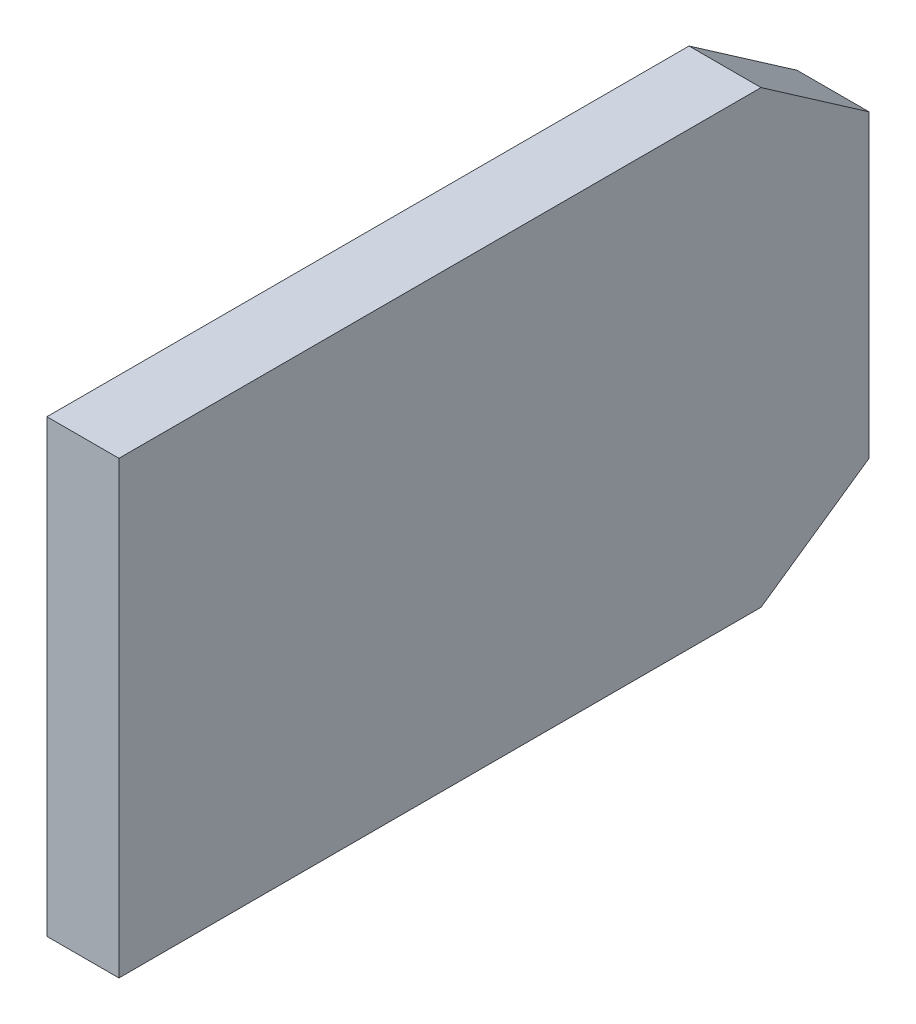
ISO-10303-21;
HEADER;
FILE_DESCRIPTION(('STEP AP214'),'2;1');
FILE_NAME('part.step','',(''),(''),'','','');
FILE_SCHEMA(('AUTOMOTIVE_DESIGN { 1 0 10303 214 1 1 1 1 }'));
ENDSEC;
DATA;
#1=APPLICATION_CONTEXT('core data for automotive mechanical design processes');
#2=APPLICATION_PROTOCOL_DEFINITION('international standard','automotive_design',2000,#1);
#3=PRODUCT_CONTEXT('',#1,'mechanical');
#4=PRODUCT('Part','Part','',(#3));
#5=PRODUCT_RELATED_PRODUCT_CATEGORY('part','',(#4));
#6=PRODUCT_DEFINITION_FORMATION('','',#4);
#7=PRODUCT_DEFINITION_CONTEXT('part definition',#1,'design');
#8=PRODUCT_DEFINITION('design','',#6,#7);
#9=PRODUCT_DEFINITION_SHAPE('','',#8);
#10=(LENGTH_UNIT() NAMED_UNIT(*) SI_UNIT(.MILLI.,.METRE.));
#11=(NAMED_UNIT(*) PLANE_ANGLE_UNIT() SI_UNIT($,.RADIAN.));
#12=(NAMED_UNIT(*) SI_UNIT($,.STERADIAN.) SOLID_ANGLE_UNIT());
#13=UNCERTAINTY_MEASURE_WITH_UNIT(LENGTH_MEASURE(1.E-05),#10,'distance_accuracy_value','');
#14=(GEOMETRIC_REPRESENTATION_CONTEXT(3) GLOBAL_UNCERTAINTY_ASSIGNED_CONTEXT((#13)) GLOBAL_UNIT_ASSIGNED_CONTEXT((#10,
#11,#12)) REPRESENTATION_CONTEXT('',''));
#15=CARTESIAN_POINT('',(0.,0.,0.));
#16=DIRECTION('',(0.,0.,1.));
#17=DIRECTION('',(1.,0.,0.));
#18=AXIS2_PLACEMENT_3D('',#15,#16,#17);
#19=CARTESIAN_POINT('',(-4.73075000000017,1.16063201513406,-16.2306000000013));
#20=DIRECTION('',(-1.,0.,0.));
#21=DIRECTION('',(0.,0.,1.));
#22=AXIS2_PLACEMENT_3D('',#19,#20,#21);
#23=PLANE('',#22);
#24=DIRECTION('',(0.,1.,0.));
#25=VECTOR('',#24,1.);
#26=CARTESIAN_POINT('',(-4.73075000000017,2.06621600756764,-16.2306000000026));
#27=LINE('',#26,#25);
#28=CARTESIAN_POINT('',(-4.73075000000017,-3.60186798486594,-16.2306000000019));
#29=VERTEX_POINT('',#28);
#30=CARTESIAN_POINT('',(-4.73075000000017,1.16063201513406,-16.2306000000016));
#31=VERTEX_POINT('',#30);
#32=EDGE_CURVE('E81',#29,#31,#27,.T.);
#33=ORIENTED_EDGE('',*,*,#32,.T.);
#34=DIRECTION('',(0.,0.,1.));
#35=VECTOR('',#34,1.);
#36=CARTESIAN_POINT('',(-4.73075000000017,1.16063201513406,-16.2306000000013));
#37=LINE('',#36,#35);
#38=CARTESIAN_POINT('',(-4.73075000000017,1.16063201513406,-23.0251000000013));
#39=VERTEX_POINT('',#38);
#40=EDGE_CURVE('E68',#39,#31,#37,.T.);
#41=ORIENTED_EDGE('',*,*,#40,.F.);
#42=DIRECTION('',(0.,0.570395809495343,0.821369965673297));
#43=VECTOR('',#42,1.);
#44=CARTESIAN_POINT('',(-4.73075000000017,0.763757015134061,-23.5966000000013));
#45=LINE('',#44,#43);
#46=CARTESIAN_POINT('',(-4.73075000000017,0.366882015134067,-24.1681000000013));
#47=VERTEX_POINT('',#46);
#48=EDGE_CURVE('E20',#47,#39,#45,.T.);
#49=ORIENTED_EDGE('',*,*,#48,.F.);
#50=DIRECTION('',(0.,1.,0.));
#51=VECTOR('',#50,1.);
#52=CARTESIAN_POINT('',(-4.73075000000017,-1.22061798486595,-24.1681000000013));
#53=LINE('',#52,#51);
#54=CARTESIAN_POINT('',(-4.73075000000017,-2.80811798486594,-24.1681000000013));
#55=VERTEX_POINT('',#54);
#56=EDGE_CURVE('E102',#47,#55,#53,.F.);
#57=ORIENTED_EDGE('',*,*,#56,.T.);
#58=DIRECTION('',(0.,0.570395809495342,-0.821369965673297));
#59=VECTOR('',#58,1.);
#60=CARTESIAN_POINT('',(-4.73075000000019,-3.20499298486595,-23.5966000000013));
#61=LINE('',#60,#59);
#62=CARTESIAN_POINT('',(-4.73075000000017,-3.60186798486594,-23.0251000000013));
#63=VERTEX_POINT('',#62);
#64=EDGE_CURVE('E100',#63,#55,#61,.T.);
#65=ORIENTED_EDGE('',*,*,#64,.F.);
#66=DIRECTION('',(0.,0.,1.));
#67=VECTOR('',#66,1.);
#68=CARTESIAN_POINT('',(-4.73075000000017,-3.60186798486595,-16.2306000000013));
#69=LINE('',#68,#67);
#70=EDGE_CURVE('E95',#29,#63,#69,.F.);
#71=ORIENTED_EDGE('',*,*,#70,.F.);
#72=EDGE_LOOP('',(#33,#41,#49,#57,#65,#71));
#73=FACE_BOUND('',#72,.T.);
#74=ADVANCED_FACE('F17',(#73),#23,.T.);
#75=CARTESIAN_POINT('',(-4.15925000000017,0.763757015134061,-23.5966000000013));
#76=DIRECTION('',(0.,0.821369965673297,-0.570395809495343));
#77=DIRECTION('',(0.,0.570395809495343,0.821369965673297));
#78=AXIS2_PLACEMENT_3D('',#75,#76,#77);
#79=PLANE('',#78);
#80=DIRECTION('',(0.,0.570395809495341,0.821369965673298));
#81=VECTOR('',#80,1.);
#82=CARTESIAN_POINT('',(-3.96875000000017,0.366882015134067,-24.1681000000013));
#83=LINE('',#82,#81);
#84=CARTESIAN_POINT('',(-3.96875000000017,0.366882015134066,-24.1681000000013));
#85=VERTEX_POINT('',#84);
#86=CARTESIAN_POINT('',(-3.96875000000017,1.16063201513406,-23.0251000000013));
#87=VERTEX_POINT('',#86);
#88=EDGE_CURVE('E106',#85,#87,#83,.T.);
#89=ORIENTED_EDGE('',*,*,#88,.F.);
#90=DIRECTION('',(1.,0.,0.));
#91=VECTOR('',#90,1.);
#92=CARTESIAN_POINT('',(-4.34975000000017,0.366882015134067,-24.1681000000013));
#93=LINE('',#92,#91);
#94=EDGE_CURVE('E77',#85,#47,#93,.F.);
#95=ORIENTED_EDGE('',*,*,#94,.T.);
#96=ORIENTED_EDGE('',*,*,#48,.T.);
#97=DIRECTION('',(-1.,0.,0.));
#98=VECTOR('',#97,1.);
#99=CARTESIAN_POINT('',(-3.96875000000017,1.16063201513406,-23.0251000000013));
#100=LINE('',#99,#98);
#101=EDGE_CURVE('E74',#87,#39,#100,.T.);
#102=ORIENTED_EDGE('',*,*,#101,.F.);
#103=EDGE_LOOP('',(#89,#95,#96,#102));
#104=FACE_BOUND('',#103,.T.);
#105=ADVANCED_FACE('F73',(#104),#79,.T.);
#106=CARTESIAN_POINT('',(-3.96875000000017,1.16063201513406,-16.2306000000013));
#107=DIRECTION('',(0.,1.,0.));
#108=DIRECTION('',(-1.,0.,0.));
#109=AXIS2_PLACEMENT_3D('',#106,#107,#108);
#110=PLANE('',#109);
#111=DIRECTION('',(-1.,0.,0.));
#112=VECTOR('',#111,1.);
#113=CARTESIAN_POINT('',(-2.66453525910038E-13,1.16063201513406,-16.2306000000026));
#114=LINE('',#113,#112);
#115=CARTESIAN_POINT('',(-3.96875000000017,1.16063201513406,-16.2306000000016));
#116=VERTEX_POINT('',#115);
#117=EDGE_CURVE('E83',#31,#116,#114,.F.);
#118=ORIENTED_EDGE('',*,*,#117,.T.);
#119=DIRECTION('',(0.,0.,-1.));
#120=VECTOR('',#119,1.);
#121=CARTESIAN_POINT('',(-3.96875000000017,1.16063201513406,-16.2306000000013));
#122=LINE('',#121,#120);
#123=EDGE_CURVE('E87',#87,#116,#122,.F.);
#124=ORIENTED_EDGE('',*,*,#123,.F.);
#125=ORIENTED_EDGE('',*,*,#101,.T.);
#126=ORIENTED_EDGE('',*,*,#40,.T.);
#127=EDGE_LOOP('',(#118,#124,#125,#126));
#128=FACE_BOUND('',#127,.T.);
#129=ADVANCED_FACE('F85',(#128),#110,.T.);
#130=CARTESIAN_POINT('',(-2.66453525910038E-13,2.06621600756764,-16.2306000000026));
#131=DIRECTION('',(0.,0.,-1.));
#132=DIRECTION('',(-1.,0.,0.));
#133=AXIS2_PLACEMENT_3D('',#130,#131,#132);
#134=PLANE('',#133);
#135=DIRECTION('',(1.,0.,0.));
#136=VECTOR('',#135,1.);
#137=CARTESIAN_POINT('',(-4.73075000000017,-3.60186798486595,-16.2306000000013));
#138=LINE('',#137,#136);
#139=CARTESIAN_POINT('',(-3.96875000000018,-3.60186798486595,-16.2306000000019));
#140=VERTEX_POINT('',#139);
#141=EDGE_CURVE('E92',#140,#29,#138,.F.);
#142=ORIENTED_EDGE('',*,*,#141,.F.);
#143=DIRECTION('',(0.,1.,0.));
#144=VECTOR('',#143,1.);
#145=CARTESIAN_POINT('',(-3.96875000000017,-3.60186798486595,-16.2306000000013));
#146=LINE('',#145,#144);
#147=EDGE_CURVE('E109',#116,#140,#146,.F.);
#148=ORIENTED_EDGE('',*,*,#147,.F.);
#149=ORIENTED_EDGE('',*,*,#117,.F.);
#150=ORIENTED_EDGE('',*,*,#32,.F.);
#151=EDGE_LOOP('',(#142,#148,#149,#150));
#152=FACE_BOUND('',#151,.T.);
#153=ADVANCED_FACE('F137',(#152),#134,.F.);
#154=CARTESIAN_POINT('',(-4.73075000000017,-3.60186798486595,-16.2306000000013));
#155=DIRECTION('',(0.,-1.,0.));
#156=DIRECTION('',(1.,0.,0.));
#157=AXIS2_PLACEMENT_3D('',#154,#155,#156);
#158=PLANE('',#157);
#159=ORIENTED_EDGE('',*,*,#141,.T.);
#160=ORIENTED_EDGE('',*,*,#70,.T.);
#161=DIRECTION('',(1.,0.,0.));
#162=VECTOR('',#161,1.);
#163=CARTESIAN_POINT('',(-4.54025000000019,-3.60186798486594,-23.0251000000013));
#164=LINE('',#163,#162);
#165=CARTESIAN_POINT('',(-3.96875000000018,-3.60186798486595,-23.0251000000013));
#166=VERTEX_POINT('',#165);
#167=EDGE_CURVE('E97',#166,#63,#164,.F.);
#168=ORIENTED_EDGE('',*,*,#167,.F.);
#169=DIRECTION('',(0.,0.,-1.));
#170=VECTOR('',#169,1.);
#171=CARTESIAN_POINT('',(-3.96875000000017,-3.60186798486595,-16.2306000000013));
#172=LINE('',#171,#170);
#173=EDGE_CURVE('E112',#140,#166,#172,.T.);
#174=ORIENTED_EDGE('',*,*,#173,.F.);
#175=EDGE_LOOP('',(#159,#160,#168,#174));
#176=FACE_BOUND('',#175,.T.);
#177=ADVANCED_FACE('F122',(#176),#158,.T.);
#178=CARTESIAN_POINT('',(-4.54025000000019,-3.20499298486595,-23.5966000000013));
#179=DIRECTION('',(0.,-0.821369965673297,-0.570395809495342));
#180=DIRECTION('',(0.,0.570395809495342,-0.821369965673297));
#181=AXIS2_PLACEMENT_3D('',#178,#179,#180);
#182=PLANE('',#181);
#183=ORIENTED_EDGE('',*,*,#64,.T.);
#184=DIRECTION('',(1.,0.,0.));
#185=VECTOR('',#184,1.);
#186=CARTESIAN_POINT('',(-4.34975000000017,-2.80811798486594,-24.1681000000013));
#187=LINE('',#186,#185);
#188=CARTESIAN_POINT('',(-3.96875000000017,-2.80811798486594,-24.1681000000013));
#189=VERTEX_POINT('',#188);
#190=EDGE_CURVE('E35',#55,#189,#187,.T.);
#191=ORIENTED_EDGE('',*,*,#190,.T.);
#192=DIRECTION('',(0.,0.57039580949534,-0.821369965673299));
#193=VECTOR('',#192,1.);
#194=CARTESIAN_POINT('',(-3.96875000000017,-3.60186798486593,-23.0251000000013));
#195=LINE('',#194,#193);
#196=EDGE_CURVE('E26',#166,#189,#195,.T.);
#197=ORIENTED_EDGE('',*,*,#196,.F.);
#198=ORIENTED_EDGE('',*,*,#167,.T.);
#199=EDGE_LOOP('',(#183,#191,#197,#198));
#200=FACE_BOUND('',#199,.T.);
#201=ADVANCED_FACE('F119',(#200),#182,.T.);
#202=CARTESIAN_POINT('',(-4.34975000000017,-1.22061798486595,-24.1681000000013));
#203=DIRECTION('',(0.,0.,1.));
#204=DIRECTION('',(1.,0.,0.));
#205=AXIS2_PLACEMENT_3D('',#202,#203,#204);
#206=PLANE('',#205);
#207=DIRECTION('',(0.,1.,0.));
#208=VECTOR('',#207,1.);
#209=CARTESIAN_POINT('',(-3.96875000000017,-3.60186798486595,-24.1681000000013));
#210=LINE('',#209,#208);
#211=EDGE_CURVE('E11',#189,#85,#210,.T.);
#212=ORIENTED_EDGE('',*,*,#211,.F.);
#213=ORIENTED_EDGE('',*,*,#190,.F.);
#214=ORIENTED_EDGE('',*,*,#56,.F.);
#215=ORIENTED_EDGE('',*,*,#94,.F.);
#216=EDGE_LOOP('',(#212,#213,#214,#215));
#217=FACE_BOUND('',#216,.T.);
#218=ADVANCED_FACE('F124',(#217),#206,.F.);
#219=CARTESIAN_POINT('',(-3.96875000000017,-3.60186798486595,-16.2306000000013));
#220=DIRECTION('',(1.,0.,0.));
#221=DIRECTION('',(0.,0.,-1.));
#222=AXIS2_PLACEMENT_3D('',#219,#220,#221);
#223=PLANE('',#222);
#224=ORIENTED_EDGE('',*,*,#196,.T.);
#225=ORIENTED_EDGE('',*,*,#211,.T.);
#226=ORIENTED_EDGE('',*,*,#88,.T.);
#227=ORIENTED_EDGE('',*,*,#123,.T.);
#228=ORIENTED_EDGE('',*,*,#147,.T.);
#229=ORIENTED_EDGE('',*,*,#173,.T.);
#230=EDGE_LOOP('',(#224,#225,#226,#227,#228,#229));
#231=FACE_BOUND('',#230,.T.);
#232=ADVANCED_FACE('F117',(#231),#223,.T.);
#233=CLOSED_SHELL('',(#74,#105,#129,#153,#177,#201,#218,#232));
#234=MANIFOLD_SOLID_BREP('B1',#233);
#235=ADVANCED_BREP_SHAPE_REPRESENTATION('',(#18,#234),#14);
#236=SHAPE_DEFINITION_REPRESENTATION(#9,#235);
ENDSEC;
END-ISO-10303-21;
